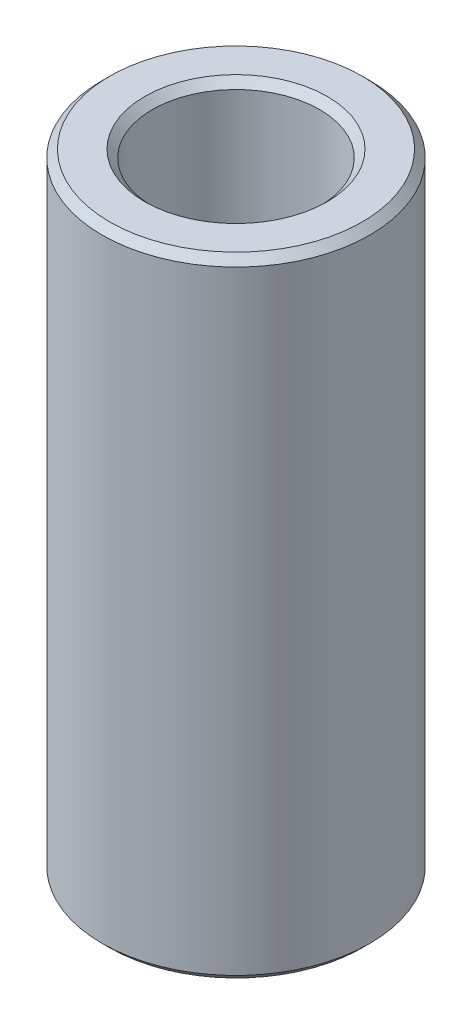
ISO-10303-21;
HEADER;
FILE_DESCRIPTION(('STEP AP214'),'2;1');
FILE_NAME('part.step','',(''),(''),'','','');
FILE_SCHEMA(('AUTOMOTIVE_DESIGN { 1 0 10303 214 1 1 1 1 }'));
ENDSEC;
DATA;
#1=APPLICATION_CONTEXT('core data for automotive mechanical design processes');
#2=APPLICATION_PROTOCOL_DEFINITION('international standard','automotive_design',2000,#1);
#3=PRODUCT_CONTEXT('',#1,'mechanical');
#4=PRODUCT('Part','Part','',(#3));
#5=PRODUCT_RELATED_PRODUCT_CATEGORY('part','',(#4));
#6=PRODUCT_DEFINITION_FORMATION('','',#4);
#7=PRODUCT_DEFINITION_CONTEXT('part definition',#1,'design');
#8=PRODUCT_DEFINITION('design','',#6,#7);
#9=PRODUCT_DEFINITION_SHAPE('','',#8);
#10=(LENGTH_UNIT() NAMED_UNIT(*) SI_UNIT(.MILLI.,.METRE.));
#11=(NAMED_UNIT(*) PLANE_ANGLE_UNIT() SI_UNIT($,.RADIAN.));
#12=(NAMED_UNIT(*) SI_UNIT($,.STERADIAN.) SOLID_ANGLE_UNIT());
#13=UNCERTAINTY_MEASURE_WITH_UNIT(LENGTH_MEASURE(1.E-05),#10,'distance_accuracy_value','');
#14=(GEOMETRIC_REPRESENTATION_CONTEXT(3) GLOBAL_UNCERTAINTY_ASSIGNED_CONTEXT((#13)) GLOBAL_UNIT_ASSIGNED_CONTEXT((#10,
#11,#12)) REPRESENTATION_CONTEXT('',''));
#15=CARTESIAN_POINT('',(0.,0.,0.));
#16=DIRECTION('',(0.,0.,1.));
#17=DIRECTION('',(1.,0.,0.));
#18=AXIS2_PLACEMENT_3D('',#15,#16,#17);
#19=CARTESIAN_POINT('',(0.,176.118679991229,0.));
#20=DIRECTION('',(0.,-1.,0.));
#21=DIRECTION('',(0.,0.,-1.));
#22=AXIS2_PLACEMENT_3D('',#19,#20,#21);
#23=CYLINDRICAL_SURFACE('',#22,37.5);
#24=CARTESIAN_POINT('',(0.,2.12409029479782,0.));
#25=DIRECTION('',(0.,1.,0.));
#26=DIRECTION('',(0.,0.,1.));
#27=AXIS2_PLACEMENT_3D('',#24,#25,#26);
#28=CIRCLE('',#27,37.5);
#29=CARTESIAN_POINT('',(0.,2.12409029479782,37.5));
#30=VERTEX_POINT('',#29);
#31=EDGE_CURVE('E10',#30,#30,#28,.T.);
#32=ORIENTED_EDGE('',*,*,#31,.T.);
#33=EDGE_LOOP('',(#32));
#34=FACE_BOUND('',#33,.T.);
#35=CARTESIAN_POINT('',(0.,173.994589696431,0.));
#36=DIRECTION('',(0.,1.,0.));
#37=DIRECTION('',(0.,0.,1.));
#38=AXIS2_PLACEMENT_3D('',#35,#36,#37);
#39=CIRCLE('',#38,37.5);
#40=CARTESIAN_POINT('',(0.,173.994589696431,37.5));
#41=VERTEX_POINT('',#40);
#42=EDGE_CURVE('E50',#41,#41,#39,.F.);
#43=ORIENTED_EDGE('',*,*,#42,.T.);
#44=EDGE_LOOP('',(#43));
#45=FACE_BOUND('',#44,.T.);
#46=ADVANCED_FACE('F39',(#34,#45),#23,.T.);
#47=CARTESIAN_POINT('',(0.,176.118679991229,0.));
#48=DIRECTION('',(0.,1.,0.));
#49=DIRECTION('',(0.,0.,1.));
#50=AXIS2_PLACEMENT_3D('',#47,#48,#49);
#51=PLANE('',#50);
#52=CARTESIAN_POINT('',(0.,176.118679991229,0.));
#53=DIRECTION('',(0.,1.,0.));
#54=DIRECTION('',(0.,0.,1.));
#55=AXIS2_PLACEMENT_3D('',#52,#53,#54);
#56=CIRCLE('',#55,25.5641566009702);
#57=CARTESIAN_POINT('',(0.,176.118679991229,25.5641566009702));
#58=VERTEX_POINT('',#57);
#59=EDGE_CURVE('E58',#58,#58,#56,.F.);
#60=ORIENTED_EDGE('',*,*,#59,.T.);
#61=EDGE_LOOP('',(#60));
#62=FACE_BOUND('',#61,.T.);
#63=CARTESIAN_POINT('',(0.,176.118679991229,0.));
#64=DIRECTION('',(0.,1.,0.));
#65=DIRECTION('',(0.,0.,1.));
#66=AXIS2_PLACEMENT_3D('',#63,#64,#65);
#67=CIRCLE('',#66,35.3759097052022);
#68=CARTESIAN_POINT('',(0.,176.118679991229,35.3759097052022));
#69=VERTEX_POINT('',#68);
#70=EDGE_CURVE('E61',#69,#69,#67,.T.);
#71=ORIENTED_EDGE('',*,*,#70,.T.);
#72=EDGE_LOOP('',(#71));
#73=FACE_BOUND('',#72,.T.);
#74=ADVANCED_FACE('F88',(#62,#73),#51,.T.);
#75=CARTESIAN_POINT('',(0.,0.,0.));
#76=DIRECTION('',(0.,1.,0.));
#77=DIRECTION('',(0.,0.,1.));
#78=AXIS2_PLACEMENT_3D('',#75,#76,#77);
#79=PLANE('',#78);
#80=CARTESIAN_POINT('',(0.,0.,0.));
#81=DIRECTION('',(0.,1.,0.));
#82=DIRECTION('',(0.,0.,1.));
#83=AXIS2_PLACEMENT_3D('',#80,#81,#82);
#84=CIRCLE('',#83,25.5641566009703);
#85=CARTESIAN_POINT('',(0.,0.,25.5641566009703));
#86=VERTEX_POINT('',#85);
#87=EDGE_CURVE('E51',#86,#86,#84,.T.);
#88=ORIENTED_EDGE('',*,*,#87,.T.);
#89=EDGE_LOOP('',(#88));
#90=FACE_BOUND('',#89,.T.);
#91=CARTESIAN_POINT('',(0.,0.,0.));
#92=DIRECTION('',(0.,1.,0.));
#93=DIRECTION('',(0.,0.,1.));
#94=AXIS2_PLACEMENT_3D('',#91,#92,#93);
#95=CIRCLE('',#94,35.3759097052022);
#96=CARTESIAN_POINT('',(0.,0.,35.3759097052022));
#97=VERTEX_POINT('',#96);
#98=EDGE_CURVE('E54',#97,#97,#95,.F.);
#99=ORIENTED_EDGE('',*,*,#98,.T.);
#100=EDGE_LOOP('',(#99));
#101=FACE_BOUND('',#100,.T.);
#102=ADVANCED_FACE('F83',(#90,#101),#79,.F.);
#103=CARTESIAN_POINT('',(0.,176.118679991229,0.));
#104=DIRECTION('',(0.,-1.,0.));
#105=DIRECTION('',(0.,0.,-1.));
#106=AXIS2_PLACEMENT_3D('',#103,#104,#105);
#107=CYLINDRICAL_SURFACE('',#106,23.4400663061724);
#108=CARTESIAN_POINT('',(0.,173.994589696431,0.));
#109=DIRECTION('',(0.,1.,0.));
#110=DIRECTION('',(0.,0.,1.));
#111=AXIS2_PLACEMENT_3D('',#108,#109,#110);
#112=CIRCLE('',#111,23.4400663061724);
#113=CARTESIAN_POINT('',(0.,173.994589696431,23.4400663061724));
#114=VERTEX_POINT('',#113);
#115=EDGE_CURVE('E67',#114,#114,#112,.T.);
#116=ORIENTED_EDGE('',*,*,#115,.T.);
#117=EDGE_LOOP('',(#116));
#118=FACE_BOUND('',#117,.T.);
#119=CARTESIAN_POINT('',(0.,2.12409029479788,0.));
#120=DIRECTION('',(0.,1.,0.));
#121=DIRECTION('',(0.,0.,1.));
#122=AXIS2_PLACEMENT_3D('',#119,#120,#121);
#123=CIRCLE('',#122,23.4400663061724);
#124=CARTESIAN_POINT('',(0.,2.12409029479788,23.4400663061724));
#125=VERTEX_POINT('',#124);
#126=EDGE_CURVE('E69',#125,#125,#123,.F.);
#127=ORIENTED_EDGE('',*,*,#126,.T.);
#128=EDGE_LOOP('',(#127));
#129=FACE_BOUND('',#128,.T.);
#130=ADVANCED_FACE('F71',(#118,#129),#107,.F.);
#131=CARTESIAN_POINT('',(0.,173.994589696431,0.));
#132=DIRECTION('',(0.,1.,0.));
#133=DIRECTION('',(0.,0.,1.));
#134=AXIS2_PLACEMENT_3D('',#131,#132,#133);
#135=CONICAL_SURFACE('',#134,23.4400663061724,0.785398163397449);
#136=ORIENTED_EDGE('',*,*,#59,.F.);
#137=EDGE_LOOP('',(#136));
#138=FACE_BOUND('',#137,.T.);
#139=ORIENTED_EDGE('',*,*,#115,.F.);
#140=EDGE_LOOP('',(#139));
#141=FACE_BOUND('',#140,.T.);
#142=ADVANCED_FACE('F77',(#138,#141),#135,.F.);
#143=CARTESIAN_POINT('',(0.,0.,0.));
#144=DIRECTION('',(0.,-1.,0.));
#145=DIRECTION('',(0.,0.,-1.));
#146=AXIS2_PLACEMENT_3D('',#143,#144,#145);
#147=CONICAL_SURFACE('',#146,25.5641566009703,0.785398163397443);
#148=ORIENTED_EDGE('',*,*,#126,.F.);
#149=EDGE_LOOP('',(#148));
#150=FACE_BOUND('',#149,.T.);
#151=ORIENTED_EDGE('',*,*,#87,.F.);
#152=EDGE_LOOP('',(#151));
#153=FACE_BOUND('',#152,.T.);
#154=ADVANCED_FACE('F73',(#150,#153),#147,.F.);
#155=CARTESIAN_POINT('',(0.,2.12409029479782,0.));
#156=DIRECTION('',(0.,1.,0.));
#157=DIRECTION('',(0.,0.,1.));
#158=AXIS2_PLACEMENT_3D('',#155,#156,#157);
#159=CONICAL_SURFACE('',#158,37.5,0.785398163397452);
#160=ORIENTED_EDGE('',*,*,#98,.F.);
#161=EDGE_LOOP('',(#160));
#162=FACE_BOUND('',#161,.T.);
#163=ORIENTED_EDGE('',*,*,#31,.F.);
#164=EDGE_LOOP('',(#163));
#165=FACE_BOUND('',#164,.T.);
#166=ADVANCED_FACE('F76',(#162,#165),#159,.T.);
#167=CARTESIAN_POINT('',(0.,176.118679991229,0.));
#168=DIRECTION('',(0.,-1.,0.));
#169=DIRECTION('',(0.,0.,-1.));
#170=AXIS2_PLACEMENT_3D('',#167,#168,#169);
#171=CONICAL_SURFACE('',#170,35.3759097052022,0.785398163397448);
#172=ORIENTED_EDGE('',*,*,#42,.F.);
#173=EDGE_LOOP('',(#172));
#174=FACE_BOUND('',#173,.T.);
#175=ORIENTED_EDGE('',*,*,#70,.F.);
#176=EDGE_LOOP('',(#175));
#177=FACE_BOUND('',#176,.T.);
#178=ADVANCED_FACE('F45',(#174,#177),#171,.T.);
#179=CLOSED_SHELL('',(#46,#74,#102,#130,#142,#154,#166,#178));
#180=MANIFOLD_SOLID_BREP('B2',#179);
#181=ADVANCED_BREP_SHAPE_REPRESENTATION('',(#18,#180),#14);
#182=SHAPE_DEFINITION_REPRESENTATION(#9,#181);
ENDSEC;
END-ISO-10303-21;
